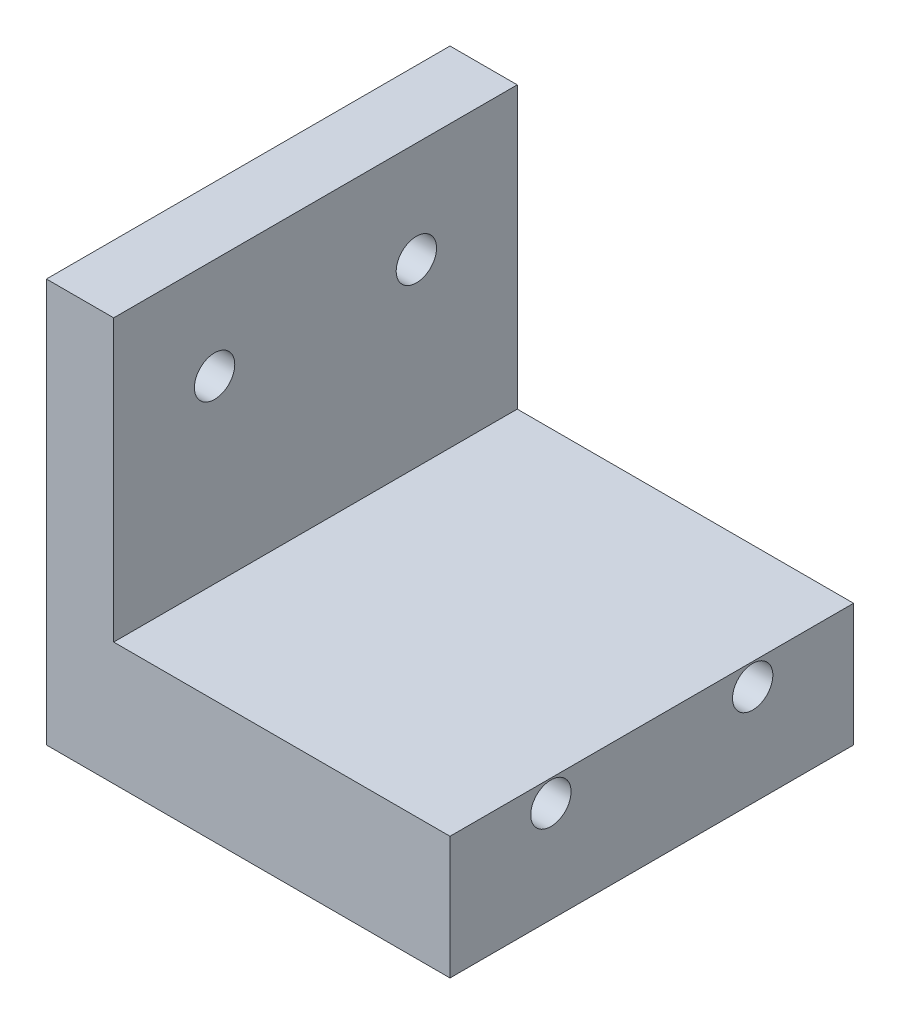
ISO-10303-21;
HEADER;
FILE_DESCRIPTION(('STEP AP214'),'2;1');
FILE_NAME('part.step','',(''),(''),'','','');
FILE_SCHEMA(('AUTOMOTIVE_DESIGN { 1 0 10303 214 1 1 1 1 }'));
ENDSEC;
DATA;
#1=APPLICATION_CONTEXT('core data for automotive mechanical design processes');
#2=APPLICATION_PROTOCOL_DEFINITION('international standard','automotive_design',2000,#1);
#3=PRODUCT_CONTEXT('',#1,'mechanical');
#4=PRODUCT('Part','Part','',(#3));
#5=PRODUCT_RELATED_PRODUCT_CATEGORY('part','',(#4));
#6=PRODUCT_DEFINITION_FORMATION('','',#4);
#7=PRODUCT_DEFINITION_CONTEXT('part definition',#1,'design');
#8=PRODUCT_DEFINITION('design','',#6,#7);
#9=PRODUCT_DEFINITION_SHAPE('','',#8);
#10=(LENGTH_UNIT() NAMED_UNIT(*) SI_UNIT(.MILLI.,.METRE.));
#11=(NAMED_UNIT(*) PLANE_ANGLE_UNIT() SI_UNIT($,.RADIAN.));
#12=(NAMED_UNIT(*) SI_UNIT($,.STERADIAN.) SOLID_ANGLE_UNIT());
#13=UNCERTAINTY_MEASURE_WITH_UNIT(LENGTH_MEASURE(1.E-05),#10,'distance_accuracy_value','');
#14=(GEOMETRIC_REPRESENTATION_CONTEXT(3) GLOBAL_UNCERTAINTY_ASSIGNED_CONTEXT((#13)) GLOBAL_UNIT_ASSIGNED_CONTEXT((#10,
#11,#12)) REPRESENTATION_CONTEXT('',''));
#15=CARTESIAN_POINT('',(0.,0.,0.));
#16=DIRECTION('',(0.,0.,1.));
#17=DIRECTION('',(1.,0.,0.));
#18=AXIS2_PLACEMENT_3D('',#15,#16,#17);
#19=CARTESIAN_POINT('',(30.,60.,-30.));
#20=DIRECTION('',(-1.,0.,0.));
#21=DIRECTION('',(0.,0.,1.));
#22=AXIS2_PLACEMENT_3D('',#19,#20,#21);
#23=PLANE('',#22);
#24=CARTESIAN_POINT('',(30.,15.,-15.));
#25=DIRECTION('',(1.,0.,0.));
#26=DIRECTION('',(0.,0.,-1.));
#27=AXIS2_PLACEMENT_3D('',#24,#25,#26);
#28=CIRCLE('',#27,3.);
#29=CARTESIAN_POINT('',(30.,15.,-18.));
#30=VERTEX_POINT('',#29);
#31=EDGE_CURVE('E151',#30,#30,#28,.T.);
#32=ORIENTED_EDGE('',*,*,#31,.F.);
#33=EDGE_LOOP('',(#32));
#34=FACE_BOUND('',#33,.T.);
#35=CARTESIAN_POINT('',(30.,15.,15.));
#36=DIRECTION('',(1.,0.,0.));
#37=DIRECTION('',(0.,0.,-1.));
#38=AXIS2_PLACEMENT_3D('',#35,#36,#37);
#39=CIRCLE('',#38,3.);
#40=CARTESIAN_POINT('',(30.,15.,12.));
#41=VERTEX_POINT('',#40);
#42=EDGE_CURVE('E142',#41,#41,#39,.T.);
#43=ORIENTED_EDGE('',*,*,#42,.F.);
#44=EDGE_LOOP('',(#43));
#45=FACE_BOUND('',#44,.T.);
#46=DIRECTION('',(0.,-1.,0.));
#47=VECTOR('',#46,1.);
#48=CARTESIAN_POINT('',(30.,60.,-30.));
#49=LINE('',#48,#47);
#50=CARTESIAN_POINT('',(30.,18.25,-30.));
#51=VERTEX_POINT('',#50);
#52=CARTESIAN_POINT('',(30.,0.,-30.));
#53=VERTEX_POINT('',#52);
#54=EDGE_CURVE('E11',#51,#53,#49,.T.);
#55=ORIENTED_EDGE('',*,*,#54,.F.);
#56=DIRECTION('',(0.,0.,1.));
#57=VECTOR('',#56,1.);
#58=CARTESIAN_POINT('',(30.,18.25,-30.001));
#59=LINE('',#58,#57);
#60=CARTESIAN_POINT('',(30.,18.25,30.));
#61=VERTEX_POINT('',#60);
#62=EDGE_CURVE('E82',#51,#61,#59,.T.);
#63=ORIENTED_EDGE('',*,*,#62,.T.);
#64=DIRECTION('',(0.,-1.,0.));
#65=VECTOR('',#64,1.);
#66=CARTESIAN_POINT('',(30.,60.,30.));
#67=LINE('',#66,#65);
#68=CARTESIAN_POINT('',(30.,0.,30.));
#69=VERTEX_POINT('',#68);
#70=EDGE_CURVE('E75',#61,#69,#67,.T.);
#71=ORIENTED_EDGE('',*,*,#70,.T.);
#72=DIRECTION('',(0.,0.,-1.));
#73=VECTOR('',#72,1.);
#74=CARTESIAN_POINT('',(30.,0.,-30.));
#75=LINE('',#74,#73);
#76=EDGE_CURVE('E79',#69,#53,#75,.T.);
#77=ORIENTED_EDGE('',*,*,#76,.T.);
#78=EDGE_LOOP('',(#55,#63,#71,#77));
#79=FACE_BOUND('',#78,.T.);
#80=ADVANCED_FACE('F33',(#34,#45,#79),#23,.F.);
#81=CARTESIAN_POINT('',(-30.,60.,-30.));
#82=DIRECTION('',(0.,0.,1.));
#83=DIRECTION('',(1.,0.,0.));
#84=AXIS2_PLACEMENT_3D('',#81,#82,#83);
#85=PLANE('',#84);
#86=DIRECTION('',(-1.,0.,0.));
#87=VECTOR('',#86,1.);
#88=CARTESIAN_POINT('',(20.,18.25,-30.));
#89=LINE('',#88,#87);
#90=CARTESIAN_POINT('',(-20.,18.25,-30.));
#91=VERTEX_POINT('',#90);
#92=EDGE_CURVE('E121',#51,#91,#89,.T.);
#93=ORIENTED_EDGE('',*,*,#92,.F.);
#94=ORIENTED_EDGE('',*,*,#54,.T.);
#95=DIRECTION('',(-1.,0.,0.));
#96=VECTOR('',#95,1.);
#97=CARTESIAN_POINT('',(-30.,0.,-30.));
#98=LINE('',#97,#96);
#99=CARTESIAN_POINT('',(-30.,0.,-30.));
#100=VERTEX_POINT('',#99);
#101=EDGE_CURVE('E100',#53,#100,#98,.T.);
#102=ORIENTED_EDGE('',*,*,#101,.T.);
#103=DIRECTION('',(0.,-1.,0.));
#104=VECTOR('',#103,1.);
#105=CARTESIAN_POINT('',(-30.,60.,-30.));
#106=LINE('',#105,#104);
#107=CARTESIAN_POINT('',(-30.,60.,-30.));
#108=VERTEX_POINT('',#107);
#109=EDGE_CURVE('E40',#108,#100,#106,.T.);
#110=ORIENTED_EDGE('',*,*,#109,.F.);
#111=DIRECTION('',(-1.,0.,0.));
#112=VECTOR('',#111,1.);
#113=CARTESIAN_POINT('',(-30.,60.,-30.));
#114=LINE('',#113,#112);
#115=CARTESIAN_POINT('',(-20.,60.,-30.));
#116=VERTEX_POINT('',#115);
#117=EDGE_CURVE('E95',#116,#108,#114,.T.);
#118=ORIENTED_EDGE('',*,*,#117,.F.);
#119=DIRECTION('',(0.,1.,0.));
#120=VECTOR('',#119,1.);
#121=CARTESIAN_POINT('',(-20.,60.,-30.));
#122=LINE('',#121,#120);
#123=EDGE_CURVE('E47',#91,#116,#122,.T.);
#124=ORIENTED_EDGE('',*,*,#123,.F.);
#125=EDGE_LOOP('',(#93,#94,#102,#110,#118,#124));
#126=FACE_BOUND('',#125,.T.);
#127=ADVANCED_FACE('F118',(#126),#85,.F.);
#128=CARTESIAN_POINT('',(-30.,60.,-30.));
#129=DIRECTION('',(1.,0.,0.));
#130=DIRECTION('',(0.,0.,-1.));
#131=AXIS2_PLACEMENT_3D('',#128,#129,#130);
#132=PLANE('',#131);
#133=CARTESIAN_POINT('',(-30.,15.,-15.));
#134=DIRECTION('',(1.,0.,0.));
#135=DIRECTION('',(0.,0.,-1.));
#136=AXIS2_PLACEMENT_3D('',#133,#134,#135);
#137=CIRCLE('',#136,3.);
#138=CARTESIAN_POINT('',(-30.,15.,-18.));
#139=VERTEX_POINT('',#138);
#140=EDGE_CURVE('E150',#139,#139,#137,.T.);
#141=ORIENTED_EDGE('',*,*,#140,.T.);
#142=EDGE_LOOP('',(#141));
#143=FACE_BOUND('',#142,.T.);
#144=CARTESIAN_POINT('',(-30.,45.,-15.));
#145=DIRECTION('',(1.,0.,0.));
#146=DIRECTION('',(0.,0.,-1.));
#147=AXIS2_PLACEMENT_3D('',#144,#145,#146);
#148=CIRCLE('',#147,3.);
#149=CARTESIAN_POINT('',(-30.,45.,-18.));
#150=VERTEX_POINT('',#149);
#151=EDGE_CURVE('E145',#150,#150,#148,.T.);
#152=ORIENTED_EDGE('',*,*,#151,.T.);
#153=EDGE_LOOP('',(#152));
#154=FACE_BOUND('',#153,.T.);
#155=CARTESIAN_POINT('',(-30.,15.,15.));
#156=DIRECTION('',(1.,0.,0.));
#157=DIRECTION('',(0.,0.,-1.));
#158=AXIS2_PLACEMENT_3D('',#155,#156,#157);
#159=CIRCLE('',#158,3.);
#160=CARTESIAN_POINT('',(-30.,15.,12.));
#161=VERTEX_POINT('',#160);
#162=EDGE_CURVE('E105',#161,#161,#159,.T.);
#163=ORIENTED_EDGE('',*,*,#162,.T.);
#164=EDGE_LOOP('',(#163));
#165=FACE_BOUND('',#164,.T.);
#166=CARTESIAN_POINT('',(-30.,45.,15.));
#167=DIRECTION('',(1.,0.,0.));
#168=DIRECTION('',(0.,0.,-1.));
#169=AXIS2_PLACEMENT_3D('',#166,#167,#168);
#170=CIRCLE('',#169,3.);
#171=CARTESIAN_POINT('',(-30.,45.,12.));
#172=VERTEX_POINT('',#171);
#173=EDGE_CURVE('E101',#172,#172,#170,.T.);
#174=ORIENTED_EDGE('',*,*,#173,.T.);
#175=EDGE_LOOP('',(#174));
#176=FACE_BOUND('',#175,.T.);
#177=DIRECTION('',(0.,0.,1.));
#178=VECTOR('',#177,1.);
#179=CARTESIAN_POINT('',(-30.,0.,-30.));
#180=LINE('',#179,#178);
#181=CARTESIAN_POINT('',(-30.,0.,30.));
#182=VERTEX_POINT('',#181);
#183=EDGE_CURVE('E96',#100,#182,#180,.T.);
#184=ORIENTED_EDGE('',*,*,#183,.T.);
#185=DIRECTION('',(0.,-1.,0.));
#186=VECTOR('',#185,1.);
#187=CARTESIAN_POINT('',(-30.,60.,30.));
#188=LINE('',#187,#186);
#189=CARTESIAN_POINT('',(-30.,60.,30.));
#190=VERTEX_POINT('',#189);
#191=EDGE_CURVE('E85',#190,#182,#188,.T.);
#192=ORIENTED_EDGE('',*,*,#191,.F.);
#193=DIRECTION('',(0.,0.,1.));
#194=VECTOR('',#193,1.);
#195=CARTESIAN_POINT('',(-30.,60.,-30.));
#196=LINE('',#195,#194);
#197=EDGE_CURVE('E56',#108,#190,#196,.T.);
#198=ORIENTED_EDGE('',*,*,#197,.F.);
#199=ORIENTED_EDGE('',*,*,#109,.T.);
#200=EDGE_LOOP('',(#184,#192,#198,#199));
#201=FACE_BOUND('',#200,.T.);
#202=ADVANCED_FACE('F114',(#143,#154,#165,#176,#201),#132,.F.);
#203=CARTESIAN_POINT('',(-30.,60.,30.));
#204=DIRECTION('',(0.,0.,-1.));
#205=DIRECTION('',(-1.,0.,0.));
#206=AXIS2_PLACEMENT_3D('',#203,#204,#205);
#207=PLANE('',#206);
#208=ORIENTED_EDGE('',*,*,#70,.F.);
#209=DIRECTION('',(1.,0.,0.));
#210=VECTOR('',#209,1.);
#211=CARTESIAN_POINT('',(20.,18.25,30.));
#212=LINE('',#211,#210);
#213=CARTESIAN_POINT('',(-20.,18.25,30.));
#214=VERTEX_POINT('',#213);
#215=EDGE_CURVE('E135',#214,#61,#212,.T.);
#216=ORIENTED_EDGE('',*,*,#215,.F.);
#217=DIRECTION('',(0.,-1.,0.));
#218=VECTOR('',#217,1.);
#219=CARTESIAN_POINT('',(-20.,60.,30.));
#220=LINE('',#219,#218);
#221=CARTESIAN_POINT('',(-20.,60.,30.));
#222=VERTEX_POINT('',#221);
#223=EDGE_CURVE('E134',#222,#214,#220,.T.);
#224=ORIENTED_EDGE('',*,*,#223,.F.);
#225=DIRECTION('',(1.,0.,0.));
#226=VECTOR('',#225,1.);
#227=CARTESIAN_POINT('',(-30.,60.,30.));
#228=LINE('',#227,#226);
#229=EDGE_CURVE('E86',#190,#222,#228,.T.);
#230=ORIENTED_EDGE('',*,*,#229,.F.);
#231=ORIENTED_EDGE('',*,*,#191,.T.);
#232=DIRECTION('',(1.,0.,0.));
#233=VECTOR('',#232,1.);
#234=CARTESIAN_POINT('',(-30.,0.,30.));
#235=LINE('',#234,#233);
#236=EDGE_CURVE('E90',#182,#69,#235,.T.);
#237=ORIENTED_EDGE('',*,*,#236,.T.);
#238=EDGE_LOOP('',(#208,#216,#224,#230,#231,#237));
#239=FACE_BOUND('',#238,.T.);
#240=ADVANCED_FACE('F91',(#239),#207,.F.);
#241=CARTESIAN_POINT('',(0.,60.,0.));
#242=DIRECTION('',(0.,1.,0.));
#243=DIRECTION('',(0.,0.,1.));
#244=AXIS2_PLACEMENT_3D('',#241,#242,#243);
#245=PLANE('',#244);
#246=DIRECTION('',(0.,0.,-1.));
#247=VECTOR('',#246,1.);
#248=CARTESIAN_POINT('',(-20.,60.,30.001));
#249=LINE('',#248,#247);
#250=EDGE_CURVE('E131',#222,#116,#249,.T.);
#251=ORIENTED_EDGE('',*,*,#250,.T.);
#252=ORIENTED_EDGE('',*,*,#117,.T.);
#253=ORIENTED_EDGE('',*,*,#197,.T.);
#254=ORIENTED_EDGE('',*,*,#229,.T.);
#255=EDGE_LOOP('',(#251,#252,#253,#254));
#256=FACE_BOUND('',#255,.T.);
#257=ADVANCED_FACE('F139',(#256),#245,.T.);
#258=CARTESIAN_POINT('',(0.,0.,0.));
#259=DIRECTION('',(0.,1.,0.));
#260=DIRECTION('',(0.,0.,1.));
#261=AXIS2_PLACEMENT_3D('',#258,#259,#260);
#262=PLANE('',#261);
#263=ORIENTED_EDGE('',*,*,#76,.F.);
#264=ORIENTED_EDGE('',*,*,#236,.F.);
#265=ORIENTED_EDGE('',*,*,#183,.F.);
#266=ORIENTED_EDGE('',*,*,#101,.F.);
#267=EDGE_LOOP('',(#263,#264,#265,#266));
#268=FACE_BOUND('',#267,.T.);
#269=ADVANCED_FACE('F99',(#268),#262,.F.);
#270=CARTESIAN_POINT('',(-30.,45.,15.));
#271=DIRECTION('',(1.,0.,0.));
#272=DIRECTION('',(0.,0.,-1.));
#273=AXIS2_PLACEMENT_3D('',#270,#271,#272);
#274=CYLINDRICAL_SURFACE('',#273,3.);
#275=CARTESIAN_POINT('',(-20.,45.,15.));
#276=DIRECTION('',(-1.,0.,0.));
#277=DIRECTION('',(0.,-1.,0.));
#278=AXIS2_PLACEMENT_3D('',#275,#276,#277);
#279=CIRCLE('',#278,3.);
#280=CARTESIAN_POINT('',(-20.,42.,15.));
#281=VERTEX_POINT('',#280);
#282=EDGE_CURVE('E154',#281,#281,#279,.T.);
#283=ORIENTED_EDGE('',*,*,#282,.F.);
#284=EDGE_LOOP('',(#283));
#285=FACE_BOUND('',#284,.T.);
#286=ORIENTED_EDGE('',*,*,#173,.F.);
#287=EDGE_LOOP('',(#286));
#288=FACE_BOUND('',#287,.T.);
#289=ADVANCED_FACE('F189',(#285,#288),#274,.F.);
#290=CARTESIAN_POINT('',(-30.,15.,15.));
#291=DIRECTION('',(1.,0.,0.));
#292=DIRECTION('',(0.,0.,-1.));
#293=AXIS2_PLACEMENT_3D('',#290,#291,#292);
#294=CYLINDRICAL_SURFACE('',#293,3.);
#295=ORIENTED_EDGE('',*,*,#162,.F.);
#296=EDGE_LOOP('',(#295));
#297=FACE_BOUND('',#296,.T.);
#298=ORIENTED_EDGE('',*,*,#42,.T.);
#299=EDGE_LOOP('',(#298));
#300=FACE_BOUND('',#299,.T.);
#301=ADVANCED_FACE('F186',(#297,#300),#294,.F.);
#302=CARTESIAN_POINT('',(-30.,45.,-15.));
#303=DIRECTION('',(1.,0.,0.));
#304=DIRECTION('',(0.,0.,-1.));
#305=AXIS2_PLACEMENT_3D('',#302,#303,#304);
#306=CYLINDRICAL_SURFACE('',#305,3.);
#307=CARTESIAN_POINT('',(-20.,45.,-15.));
#308=DIRECTION('',(-1.,0.,0.));
#309=DIRECTION('',(0.,-1.,0.));
#310=AXIS2_PLACEMENT_3D('',#307,#308,#309);
#311=CIRCLE('',#310,3.);
#312=CARTESIAN_POINT('',(-20.,42.,-15.));
#313=VERTEX_POINT('',#312);
#314=EDGE_CURVE('E159',#313,#313,#311,.T.);
#315=ORIENTED_EDGE('',*,*,#314,.F.);
#316=EDGE_LOOP('',(#315));
#317=FACE_BOUND('',#316,.T.);
#318=ORIENTED_EDGE('',*,*,#151,.F.);
#319=EDGE_LOOP('',(#318));
#320=FACE_BOUND('',#319,.T.);
#321=ADVANCED_FACE('F188',(#317,#320),#306,.F.);
#322=CARTESIAN_POINT('',(-30.,15.,-15.));
#323=DIRECTION('',(1.,0.,0.));
#324=DIRECTION('',(0.,0.,-1.));
#325=AXIS2_PLACEMENT_3D('',#322,#323,#324);
#326=CYLINDRICAL_SURFACE('',#325,3.);
#327=ORIENTED_EDGE('',*,*,#140,.F.);
#328=EDGE_LOOP('',(#327));
#329=FACE_BOUND('',#328,.T.);
#330=ORIENTED_EDGE('',*,*,#31,.T.);
#331=EDGE_LOOP('',(#330));
#332=FACE_BOUND('',#331,.T.);
#333=ADVANCED_FACE('F173',(#329,#332),#326,.F.);
#334=CARTESIAN_POINT('',(-20.,60.,30.001));
#335=DIRECTION('',(-1.,0.,0.));
#336=DIRECTION('',(0.,-1.,0.));
#337=AXIS2_PLACEMENT_3D('',#334,#335,#336);
#338=PLANE('',#337);
#339=ORIENTED_EDGE('',*,*,#282,.T.);
#340=EDGE_LOOP('',(#339));
#341=FACE_BOUND('',#340,.T.);
#342=ORIENTED_EDGE('',*,*,#314,.T.);
#343=EDGE_LOOP('',(#342));
#344=FACE_BOUND('',#343,.T.);
#345=ORIENTED_EDGE('',*,*,#223,.T.);
#346=DIRECTION('',(0.,0.,-1.));
#347=VECTOR('',#346,1.);
#348=CARTESIAN_POINT('',(-20.,18.25,30.001));
#349=LINE('',#348,#347);
#350=EDGE_CURVE('E136',#214,#91,#349,.T.);
#351=ORIENTED_EDGE('',*,*,#350,.T.);
#352=ORIENTED_EDGE('',*,*,#123,.T.);
#353=ORIENTED_EDGE('',*,*,#250,.F.);
#354=EDGE_LOOP('',(#345,#351,#352,#353));
#355=FACE_BOUND('',#354,.T.);
#356=ADVANCED_FACE('F133',(#341,#344,#355),#338,.F.);
#357=CARTESIAN_POINT('',(20.,18.25,30.001));
#358=DIRECTION('',(0.,-1.,0.));
#359=DIRECTION('',(0.,0.,-1.));
#360=AXIS2_PLACEMENT_3D('',#357,#358,#359);
#361=PLANE('',#360);
#362=ORIENTED_EDGE('',*,*,#215,.T.);
#363=ORIENTED_EDGE('',*,*,#62,.F.);
#364=ORIENTED_EDGE('',*,*,#92,.T.);
#365=ORIENTED_EDGE('',*,*,#350,.F.);
#366=EDGE_LOOP('',(#362,#363,#364,#365));
#367=FACE_BOUND('',#366,.T.);
#368=ADVANCED_FACE('F167',(#367),#361,.F.);
#369=CLOSED_SHELL('',(#80,#127,#202,#240,#257,#269,#289,#301,#321,#333,#356,#368));
#370=MANIFOLD_SOLID_BREP('B2',#369);
#371=ADVANCED_BREP_SHAPE_REPRESENTATION('',(#18,#370),#14);
#372=SHAPE_DEFINITION_REPRESENTATION(#9,#371);
ENDSEC;
END-ISO-10303-21;
